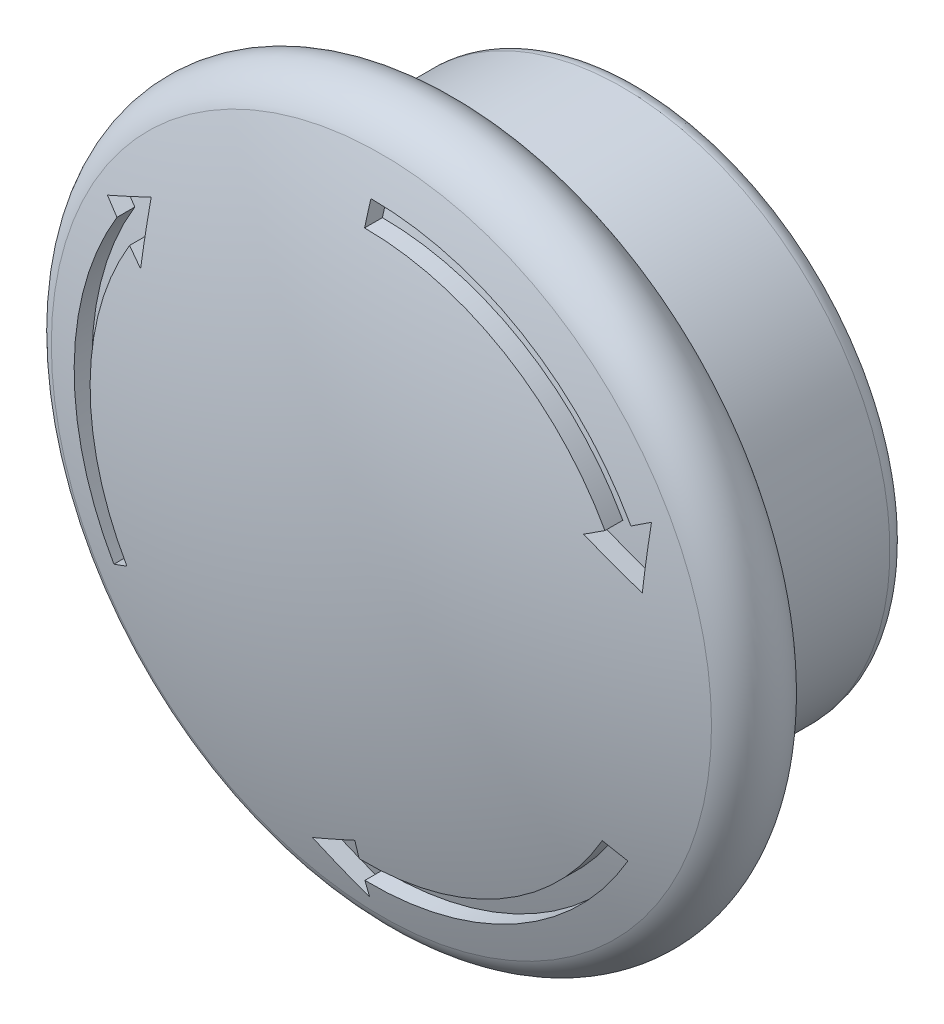
ISO-10303-21;
HEADER;
FILE_DESCRIPTION(('STEP AP214'),'2;1');
FILE_NAME('part.step','',(''),(''),'','','');
FILE_SCHEMA(('AUTOMOTIVE_DESIGN { 1 0 10303 214 1 1 1 1 }'));
ENDSEC;
DATA;
#1=APPLICATION_CONTEXT('core data for automotive mechanical design processes');
#2=APPLICATION_PROTOCOL_DEFINITION('international standard','automotive_design',2000,#1);
#3=PRODUCT_CONTEXT('',#1,'mechanical');
#4=PRODUCT('Part','Part','',(#3));
#5=PRODUCT_RELATED_PRODUCT_CATEGORY('part','',(#4));
#6=PRODUCT_DEFINITION_FORMATION('','',#4);
#7=PRODUCT_DEFINITION_CONTEXT('part definition',#1,'design');
#8=PRODUCT_DEFINITION('design','',#6,#7);
#9=PRODUCT_DEFINITION_SHAPE('','',#8);
#10=(LENGTH_UNIT() NAMED_UNIT(*) SI_UNIT(.MILLI.,.METRE.));
#11=(NAMED_UNIT(*) PLANE_ANGLE_UNIT() SI_UNIT($,.RADIAN.));
#12=(NAMED_UNIT(*) SI_UNIT($,.STERADIAN.) SOLID_ANGLE_UNIT());
#13=UNCERTAINTY_MEASURE_WITH_UNIT(LENGTH_MEASURE(1.E-05),#10,'distance_accuracy_value','');
#14=(GEOMETRIC_REPRESENTATION_CONTEXT(3) GLOBAL_UNCERTAINTY_ASSIGNED_CONTEXT((#13)) GLOBAL_UNIT_ASSIGNED_CONTEXT((#10,
#11,#12)) REPRESENTATION_CONTEXT('',''));
#15=CARTESIAN_POINT('',(0.,0.,0.));
#16=DIRECTION('',(0.,0.,1.));
#17=DIRECTION('',(1.,0.,0.));
#18=AXIS2_PLACEMENT_3D('',#15,#16,#17);
#19=CARTESIAN_POINT('',(0.,34.,32.4583333333333));
#20=DIRECTION('',(0.,0.,-1.));
#21=DIRECTION('',(1.,0.,0.));
#22=AXIS2_PLACEMENT_3D('',#19,#20,#21);
#23=SPHERICAL_SURFACE('',#22,58.5416666666667);
#24=CARTESIAN_POINT('',(0.,34.,88.));
#25=DIRECTION('',(0.,0.,-1.));
#26=DIRECTION('',(-1.,0.,0.));
#27=AXIS2_PLACEMENT_3D('',#24,#25,#26);
#28=CIRCLE('',#27,18.5);
#29=CARTESIAN_POINT('',(-18.5,34.,88.));
#30=VERTEX_POINT('',#29);
#31=EDGE_CURVE('E405',#30,#30,#28,.T.);
#32=ORIENTED_EDGE('',*,*,#31,.F.);
#33=EDGE_LOOP('',(#32));
#34=FACE_BOUND('',#33,.T.);
#35=CARTESIAN_POINT('',(15.1736395108025,33.568315174557,32.4583333333333));
#36=DIRECTION('',(-0.999595554031887,0.0284381497233161,0.));
#37=DIRECTION('',(-0.0284381497233161,-0.999595554031887,0.));
#38=AXIS2_PLACEMENT_3D('',#35,#36,#37);
#39=CIRCLE('',#38,56.5393760871024);
#40=CARTESIAN_POINT('',(15.4273371829423,42.4857400987002,88.2894735557238));
#41=VERTEX_POINT('',#40);
#42=CARTESIAN_POINT('',(15.334363418927,39.2177299765408,88.7145270237999));
#43=VERTEX_POINT('',#42);
#44=EDGE_CURVE('E431',#41,#43,#39,.F.);
#45=ORIENTED_EDGE('',*,*,#44,.T.);
#46=CARTESIAN_POINT('',(6.54714618894183,44.6299230435225,32.4583333333333));
#47=DIRECTION('',(0.524425937112959,0.851456068439937,0.));
#48=DIRECTION('',(-0.851456068439937,0.524425937112959,0.));
#49=AXIS2_PLACEMENT_3D('',#46,#47,#48);
#50=CIRCLE('',#49,57.1949853481975);
#51=CARTESIAN_POINT('',(12.55067051532,40.9322526791432,89.2170443697857));
#52=VERTEX_POINT('',#51);
#53=EDGE_CURVE('E434',#43,#52,#50,.F.);
#54=ORIENTED_EDGE('',*,*,#53,.T.);
#55=CARTESIAN_POINT('',(-0.0646001411496262,34.1196231591124,32.4583333333333));
#56=DIRECTION('',(0.475169616918934,-0.879894218163248,0.));
#57=DIRECTION('',(0.879894218163248,0.475169616918934,0.));
#58=AXIS2_PLACEMENT_3D('',#55,#56,#57);
#59=CIRCLE('',#58,58.5415088055704);
#60=CARTESIAN_POINT('',(13.4703718400252,41.4289193432932,88.9427291962034));
#61=VERTEX_POINT('',#60);
#62=EDGE_CURVE('E419',#52,#61,#59,.F.);
#63=ORIENTED_EDGE('',*,*,#62,.T.);
#64=CARTESIAN_POINT('',(0.,34.,88.9427291962034));
#65=DIRECTION('',(0.,0.,-1.));
#66=DIRECTION('',(-1.,0.,0.));
#67=AXIS2_PLACEMENT_3D('',#64,#65,#66);
#68=CIRCLE('',#67,15.3830998214826);
#69=CARTESIAN_POINT('',(0.,49.3830998214826,88.9427291962034));
#70=VERTEX_POINT('',#69);
#71=EDGE_CURVE('E417',#70,#61,#68,.T.);
#72=ORIENTED_EDGE('',*,*,#71,.F.);
#73=CARTESIAN_POINT('',(0.,34.,32.4583333333333));
#74=DIRECTION('',(1.,0.,0.));
#75=DIRECTION('',(0.,1.,0.));
#76=AXIS2_PLACEMENT_3D('',#73,#74,#75);
#77=CIRCLE('',#76,58.5416666666667);
#78=CARTESIAN_POINT('',(0.,50.6313864869628,88.5878596063421));
#79=VERTEX_POINT('',#78);
#80=EDGE_CURVE('E422',#70,#79,#77,.F.);
#81=ORIENTED_EDGE('',*,*,#80,.T.);
#82=CARTESIAN_POINT('',(0.,34.,88.5878596063421));
#83=DIRECTION('',(0.,0.,-1.));
#84=DIRECTION('',(-1.,0.,0.));
#85=AXIS2_PLACEMENT_3D('',#82,#83,#84);
#86=CIRCLE('',#85,16.6313864869628);
#87=CARTESIAN_POINT('',(14.5687717363032,42.0220886665644,88.5878596063421));
#88=VERTEX_POINT('',#87);
#89=EDGE_CURVE('E425',#79,#88,#86,.T.);
#90=ORIENTED_EDGE('',*,*,#89,.T.);
#91=CARTESIAN_POINT('',(-0.0646001411496861,34.1196231591125,32.4583333333333));
#92=DIRECTION('',(0.475169616918926,-0.879894218163252,0.));
#93=DIRECTION('',(0.879894218163253,0.475169616918926,0.));
#94=AXIS2_PLACEMENT_3D('',#91,#92,#93);
#95=CIRCLE('',#94,58.5415088055704);
#96=EDGE_CURVE('E428',#88,#41,#95,.F.);
#97=ORIENTED_EDGE('',*,*,#96,.T.);
#98=EDGE_LOOP('',(#45,#54,#63,#72,#81,#90,#97));
#99=FACE_BOUND('',#98,.T.);
#100=CARTESIAN_POINT('',(-7.21296973013926,47.3565996969438,32.4583333333333));
#101=DIRECTION('',(0.475169616918919,-0.879894218163256,0.));
#102=DIRECTION('',(0.879894218163256,0.475169616918919,0.));
#103=AXIS2_PLACEMENT_3D('',#100,#101,#102);
#104=CIRCLE('',#103,56.5393760871024);
#105=CARTESIAN_POINT('',(-15.0625350868577,43.1175958638263,88.2894735557238));
#106=VERTEX_POINT('',#105);
#107=CARTESIAN_POINT('',(-12.1858684192353,44.6710832833833,88.7145270237999));
#108=VERTEX_POINT('',#107);
#109=EDGE_CURVE('E451',#106,#108,#104,.F.);
#110=ORIENTED_EDGE('',*,*,#109,.T.);
#111=CARTESIAN_POINT('',(-12.479356490435,34.355033400153,32.4583333333333));
#112=DIRECTION('',(-0.999595554031886,0.0284381497233245,0.));
#113=DIRECTION('',(-0.0284381497233245,-0.999595554031886,0.));
#114=AXIS2_PLACEMENT_3D('',#111,#112,#113);
#115=CIRCLE('',#114,57.1949853481975);
#116=CARTESIAN_POINT('',(-12.2788421832507,41.403073161224,89.2170443697857));
#117=VERTEX_POINT('',#116);
#118=EDGE_CURVE('E454',#108,#117,#115,.F.);
#119=ORIENTED_EDGE('',*,*,#118,.T.);
#120=CARTESIAN_POINT('',(-0.071296624097556,33.8842430571201,32.4583333333333));
#121=DIRECTION('',(0.524425937112967,0.851456068439932,0.));
#122=DIRECTION('',(-0.851456068439932,0.524425937112967,0.));
#123=AXIS2_PLACEMENT_3D('',#120,#121,#122);
#124=CIRCLE('',#123,58.5415088055704);
#125=CARTESIAN_POINT('',(-13.16881879397,41.9512245402379,88.9427291962034));
#126=VERTEX_POINT('',#125);
#127=EDGE_CURVE('E439',#117,#126,#124,.F.);
#128=ORIENTED_EDGE('',*,*,#127,.T.);
#129=CARTESIAN_POINT('',(0.,34.,88.9427291962034));
#130=DIRECTION('',(0.,0.,-1.));
#131=DIRECTION('',(-1.,0.,0.));
#132=AXIS2_PLACEMENT_3D('',#129,#130,#131);
#133=CIRCLE('',#132,15.3830998214826);
#134=CARTESIAN_POINT('',(-13.3221552343559,26.3084500892588,88.9427291962034));
#135=VERTEX_POINT('',#134);
#136=EDGE_CURVE('E437',#135,#126,#133,.T.);
#137=ORIENTED_EDGE('',*,*,#136,.F.);
#138=CARTESIAN_POINT('',(0.,34.,32.4583333333333));
#139=DIRECTION('',(-0.499999999999989,0.866025403784445,0.));
#140=DIRECTION('',(-0.866025403784445,-0.499999999999989,0.));
#141=AXIS2_PLACEMENT_3D('',#138,#139,#140);
#142=CIRCLE('',#141,58.5416666666667);
#143=CARTESIAN_POINT('',(-14.4032031978671,25.6843067565187,88.5878596063421));
#144=VERTEX_POINT('',#143);
#145=EDGE_CURVE('E442',#135,#144,#142,.F.);
#146=ORIENTED_EDGE('',*,*,#145,.T.);
#147=CARTESIAN_POINT('',(0.,34.,88.5878596063421));
#148=DIRECTION('',(0.,0.,-1.));
#149=DIRECTION('',(-1.,0.,0.));
#150=AXIS2_PLACEMENT_3D('',#147,#148,#149);
#151=CIRCLE('',#150,16.6313864869628);
#152=CARTESIAN_POINT('',(-14.2317184448076,42.6058820922932,88.5878596063421));
#153=VERTEX_POINT('',#152);
#154=EDGE_CURVE('E445',#144,#153,#151,.T.);
#155=ORIENTED_EDGE('',*,*,#154,.T.);
#156=CARTESIAN_POINT('',(-0.0712966240975966,33.88424305712,32.4583333333333));
#157=DIRECTION('',(0.524425937112971,0.85145606843993,0.));
#158=DIRECTION('',(-0.85145606843993,0.524425937112971,0.));
#159=AXIS2_PLACEMENT_3D('',#156,#157,#158);
#160=CIRCLE('',#159,58.5415088055704);
#161=EDGE_CURVE('E448',#153,#106,#160,.F.);
#162=ORIENTED_EDGE('',*,*,#161,.T.);
#163=EDGE_LOOP('',(#110,#119,#128,#137,#146,#155,#162));
#164=FACE_BOUND('',#163,.T.);
#165=CARTESIAN_POINT('',(-7.96066978066316,21.0750851284993,32.4583333333333));
#166=DIRECTION('',(0.524425937112964,0.851456068439934,0.));
#167=DIRECTION('',(-0.851456068439934,0.524425937112964,0.));
#168=AXIS2_PLACEMENT_3D('',#165,#166,#167);
#169=CIRCLE('',#168,56.5393760871024);
#170=CARTESIAN_POINT('',(-0.364802096084629,16.3966640374736,88.2894735557238));
#171=VERTEX_POINT('',#170);
#172=CARTESIAN_POINT('',(-3.14849499969166,18.111186740076,88.7145270237999));
#173=VERTEX_POINT('',#172);
#174=EDGE_CURVE('E65',#171,#173,#169,.F.);
#175=ORIENTED_EDGE('',*,*,#174,.T.);
#176=CARTESIAN_POINT('',(5.93221030149311,23.0150435563246,32.4583333333333));
#177=DIRECTION('',(0.475169616918922,-0.879894218163255,0.));
#178=DIRECTION('',(0.879894218163255,0.475169616918922,0.));
#179=AXIS2_PLACEMENT_3D('',#176,#177,#178);
#180=CIRCLE('',#179,57.1949853481975);
#181=CARTESIAN_POINT('',(-0.271828332069332,19.664674159633,89.2170443697857));
#182=VERTEX_POINT('',#181);
#183=EDGE_CURVE('E12',#173,#182,#180,.F.);
#184=ORIENTED_EDGE('',*,*,#183,.T.);
#185=CARTESIAN_POINT('',(0.135896765247218,33.9961337837674,32.4583333333333));
#186=DIRECTION('',(-0.999595554031887,0.0284381497233193,0.));
#187=DIRECTION('',(-0.0284381497233193,-0.999595554031887,0.));
#188=AXIS2_PLACEMENT_3D('',#185,#186,#187);
#189=CIRCLE('',#188,58.5415088055704);
#190=CARTESIAN_POINT('',(-0.301553046055177,18.6198561164691,88.9427291962034));
#191=VERTEX_POINT('',#190);
#192=EDGE_CURVE('E459',#182,#191,#189,.F.);
#193=ORIENTED_EDGE('',*,*,#192,.T.);
#194=CARTESIAN_POINT('',(0.,34.,88.9427291962034));
#195=DIRECTION('',(0.,0.,-1.));
#196=DIRECTION('',(-1.,0.,0.));
#197=AXIS2_PLACEMENT_3D('',#194,#195,#196);
#198=CIRCLE('',#197,15.3830998214826);
#199=CARTESIAN_POINT('',(13.3221552343558,26.3084500892586,88.9427291962034));
#200=VERTEX_POINT('',#199);
#201=EDGE_CURVE('E457',#200,#191,#198,.T.);
#202=ORIENTED_EDGE('',*,*,#201,.F.);
#203=CARTESIAN_POINT('',(0.,34.0000000000001,32.4583333333333));
#204=DIRECTION('',(-0.500000000000008,-0.866025403784434,0.));
#205=DIRECTION('',(0.866025403784434,-0.500000000000008,0.));
#206=AXIS2_PLACEMENT_3D('',#203,#204,#205);
#207=CIRCLE('',#206,58.5416666666667);
#208=CARTESIAN_POINT('',(14.4032031978669,25.6843067565185,88.5878596063421));
#209=VERTEX_POINT('',#208);
#210=EDGE_CURVE('E462',#200,#209,#207,.F.);
#211=ORIENTED_EDGE('',*,*,#210,.T.);
#212=CARTESIAN_POINT('',(0.,34.,88.5878596063421));
#213=DIRECTION('',(0.,0.,-1.));
#214=DIRECTION('',(-1.,0.,0.));
#215=AXIS2_PLACEMENT_3D('',#212,#213,#214);
#216=CIRCLE('',#215,16.6313864869628);
#217=CARTESIAN_POINT('',(-0.337053291495628,17.3720292411425,88.5878596063421));
#218=VERTEX_POINT('',#217);
#219=EDGE_CURVE('E465',#209,#218,#216,.T.);
#220=ORIENTED_EDGE('',*,*,#219,.T.);
#221=CARTESIAN_POINT('',(0.135896765247465,33.9961337837674,32.4583333333333));
#222=DIRECTION('',(-0.999595554031886,0.0284381497233339,0.));
#223=DIRECTION('',(-0.0284381497233339,-0.999595554031886,0.));
#224=AXIS2_PLACEMENT_3D('',#221,#222,#223);
#225=CIRCLE('',#224,58.5415088055704);
#226=EDGE_CURVE('E468',#218,#171,#225,.F.);
#227=ORIENTED_EDGE('',*,*,#226,.T.);
#228=EDGE_LOOP('',(#175,#184,#193,#202,#211,#220,#227));
#229=FACE_BOUND('',#228,.T.);
#230=ADVANCED_FACE('F57',(#34,#99,#164,#229),#23,.T.);
#231=CARTESIAN_POINT('',(0.,34.,85.75));
#232=DIRECTION('',(0.,0.,-1.));
#233=DIRECTION('',(-1.,0.,0.));
#234=AXIS2_PLACEMENT_3D('',#231,#232,#233);
#235=TOROIDAL_SURFACE('',#234,17.5625,2.4375);
#236=ORIENTED_EDGE('',*,*,#31,.T.);
#237=EDGE_LOOP('',(#236));
#238=FACE_BOUND('',#237,.T.);
#239=CARTESIAN_POINT('',(0.,34.,83.5));
#240=DIRECTION('',(0.,0.,-1.));
#241=DIRECTION('',(-1.,0.,0.));
#242=AXIS2_PLACEMENT_3D('',#239,#240,#241);
#243=CIRCLE('',#242,18.5);
#244=CARTESIAN_POINT('',(-18.5,34.,83.5));
#245=VERTEX_POINT('',#244);
#246=EDGE_CURVE('E406',#245,#245,#243,.T.);
#247=ORIENTED_EDGE('',*,*,#246,.F.);
#248=EDGE_LOOP('',(#247));
#249=FACE_BOUND('',#248,.T.);
#250=ADVANCED_FACE('F486',(#238,#249),#235,.T.);
#251=CARTESIAN_POINT('',(0.,34.,83.5));
#252=DIRECTION('',(0.,0.,-1.));
#253=DIRECTION('',(-1.,0.,0.));
#254=AXIS2_PLACEMENT_3D('',#251,#252,#253);
#255=PLANE('',#254);
#256=CARTESIAN_POINT('',(0.,34.,83.5));
#257=DIRECTION('',(0.,0.,-1.));
#258=DIRECTION('',(-1.,0.,0.));
#259=AXIS2_PLACEMENT_3D('',#256,#257,#258);
#260=CIRCLE('',#259,15.);
#261=CARTESIAN_POINT('',(-15.,34.,83.5));
#262=VERTEX_POINT('',#261);
#263=EDGE_CURVE('E396',#262,#262,#260,.T.);
#264=ORIENTED_EDGE('',*,*,#263,.F.);
#265=EDGE_LOOP('',(#264));
#266=FACE_BOUND('',#265,.T.);
#267=ORIENTED_EDGE('',*,*,#246,.T.);
#268=EDGE_LOOP('',(#267));
#269=FACE_BOUND('',#268,.T.);
#270=ADVANCED_FACE('F492',(#266,#269),#255,.T.);
#271=CARTESIAN_POINT('',(0.,34.,73.5));
#272=DIRECTION('',(0.,0.,1.));
#273=DIRECTION('',(1.,0.,0.));
#274=AXIS2_PLACEMENT_3D('',#271,#272,#273);
#275=CYLINDRICAL_SURFACE('',#274,15.);
#276=CARTESIAN_POINT('',(0.,34.,74.5));
#277=DIRECTION('',(0.,0.,-1.));
#278=DIRECTION('',(-1.,0.,0.));
#279=AXIS2_PLACEMENT_3D('',#276,#277,#278);
#280=CIRCLE('',#279,15.);
#281=CARTESIAN_POINT('',(-15.,34.,74.5));
#282=VERTEX_POINT('',#281);
#283=EDGE_CURVE('E414',#282,#282,#280,.F.);
#284=ORIENTED_EDGE('',*,*,#283,.T.);
#285=EDGE_LOOP('',(#284));
#286=FACE_BOUND('',#285,.T.);
#287=ORIENTED_EDGE('',*,*,#263,.T.);
#288=EDGE_LOOP('',(#287));
#289=FACE_BOUND('',#288,.T.);
#290=ADVANCED_FACE('F499',(#286,#289),#275,.T.);
#291=CARTESIAN_POINT('',(0.,34.,73.5));
#292=DIRECTION('',(0.,0.,-1.));
#293=DIRECTION('',(-1.,0.,0.));
#294=AXIS2_PLACEMENT_3D('',#291,#292,#293);
#295=PLANE('',#294);
#296=CARTESIAN_POINT('',(0.,34.,73.5));
#297=DIRECTION('',(0.,0.,-1.));
#298=DIRECTION('',(-1.,0.,0.));
#299=AXIS2_PLACEMENT_3D('',#296,#297,#298);
#300=CIRCLE('',#299,14.);
#301=CARTESIAN_POINT('',(-14.,34.,73.5));
#302=VERTEX_POINT('',#301);
#303=EDGE_CURVE('E404',#302,#302,#300,.T.);
#304=ORIENTED_EDGE('',*,*,#303,.T.);
#305=EDGE_LOOP('',(#304));
#306=FACE_BOUND('',#305,.T.);
#307=ADVANCED_FACE('F502',(#306),#295,.T.);
#308=CARTESIAN_POINT('',(0.,34.,74.5));
#309=DIRECTION('',(0.,0.,-1.));
#310=DIRECTION('',(-1.,0.,0.));
#311=AXIS2_PLACEMENT_3D('',#308,#309,#310);
#312=TOROIDAL_SURFACE('',#311,14.,1.);
#313=ORIENTED_EDGE('',*,*,#283,.F.);
#314=EDGE_LOOP('',(#313));
#315=FACE_BOUND('',#314,.T.);
#316=ORIENTED_EDGE('',*,*,#303,.F.);
#317=EDGE_LOOP('',(#316));
#318=FACE_BOUND('',#317,.T.);
#319=ADVANCED_FACE('F59',(#315,#318),#312,.T.);
#320=CARTESIAN_POINT('',(15.4273371829423,42.4857400987002,88.2894735557238));
#321=DIRECTION('',(0.475169616918926,-0.879894218163252,0.));
#322=DIRECTION('',(0.879894218163253,0.475169616918926,0.));
#323=AXIS2_PLACEMENT_3D('',#320,#321,#322);
#324=PLANE('',#323);
#325=DIRECTION('',(0.,0.,1.));
#326=VECTOR('',#325,1.);
#327=CARTESIAN_POINT('',(14.5687717363032,42.0220886665644,88.5878596063421));
#328=LINE('',#327,#326);
#329=CARTESIAN_POINT('',(14.5687717363032,42.0220886665644,87.5878596063421));
#330=VERTEX_POINT('',#329);
#331=EDGE_CURVE('E813',#330,#88,#328,.T.);
#332=ORIENTED_EDGE('',*,*,#331,.F.);
#333=CARTESIAN_POINT('',(-0.0646001411496877,34.1196231591125,31.4583333333333));
#334=DIRECTION('',(-0.475169616918926,0.879894218163252,0.));
#335=DIRECTION('',(-0.879894218163252,-0.475169616918926,0.));
#336=AXIS2_PLACEMENT_3D('',#333,#334,#335);
#337=CIRCLE('',#336,58.5415088055704);
#338=CARTESIAN_POINT('',(15.4273371829423,42.4857400987002,87.2894735557238));
#339=VERTEX_POINT('',#338);
#340=EDGE_CURVE('E210',#330,#339,#337,.T.);
#341=ORIENTED_EDGE('',*,*,#340,.T.);
#342=DIRECTION('',(0.,0.,1.));
#343=VECTOR('',#342,1.);
#344=CARTESIAN_POINT('',(15.4273371829423,42.4857400987002,88.2894735557238));
#345=LINE('',#344,#343);
#346=EDGE_CURVE('E807',#339,#41,#345,.T.);
#347=ORIENTED_EDGE('',*,*,#346,.T.);
#348=ORIENTED_EDGE('',*,*,#96,.F.);
#349=EDGE_LOOP('',(#332,#341,#347,#348));
#350=FACE_BOUND('',#349,.T.);
#351=ADVANCED_FACE('F363',(#350),#324,.T.);
#352=CARTESIAN_POINT('',(0.,34.,88.5878596063421));
#353=DIRECTION('',(0.,0.,1.));
#354=DIRECTION('',(1.,0.,0.));
#355=AXIS2_PLACEMENT_3D('',#352,#353,#354);
#356=CYLINDRICAL_SURFACE('',#355,16.6313864869628);
#357=DIRECTION('',(0.,0.,1.));
#358=VECTOR('',#357,1.);
#359=CARTESIAN_POINT('',(0.,50.6313864869628,88.5878596063421));
#360=LINE('',#359,#358);
#361=CARTESIAN_POINT('',(0.,50.6313864869628,87.5878596063421));
#362=VERTEX_POINT('',#361);
#363=EDGE_CURVE('E812',#362,#79,#360,.T.);
#364=ORIENTED_EDGE('',*,*,#363,.F.);
#365=CARTESIAN_POINT('',(0.,34.,87.5878596063421));
#366=DIRECTION('',(0.,0.,-1.));
#367=DIRECTION('',(-1.,0.,0.));
#368=AXIS2_PLACEMENT_3D('',#365,#366,#367);
#369=CIRCLE('',#368,16.6313864869628);
#370=EDGE_CURVE('E819',#362,#330,#369,.T.);
#371=ORIENTED_EDGE('',*,*,#370,.T.);
#372=ORIENTED_EDGE('',*,*,#331,.T.);
#373=ORIENTED_EDGE('',*,*,#89,.F.);
#374=EDGE_LOOP('',(#364,#371,#372,#373));
#375=FACE_BOUND('',#374,.T.);
#376=ADVANCED_FACE('F366',(#375),#356,.F.);
#377=CARTESIAN_POINT('',(0.,50.6313864869628,88.5878596063421));
#378=DIRECTION('',(1.,0.,0.));
#379=DIRECTION('',(0.,1.,0.));
#380=AXIS2_PLACEMENT_3D('',#377,#378,#379);
#381=PLANE('',#380);
#382=DIRECTION('',(0.,0.,1.));
#383=VECTOR('',#382,1.);
#384=CARTESIAN_POINT('',(0.,49.3830998214826,88.9427291962034));
#385=LINE('',#384,#383);
#386=CARTESIAN_POINT('',(0.,49.3830998214826,87.9427291962034));
#387=VERTEX_POINT('',#386);
#388=EDGE_CURVE('E858',#387,#70,#385,.T.);
#389=ORIENTED_EDGE('',*,*,#388,.F.);
#390=CARTESIAN_POINT('',(0.,34.,31.4583333333333));
#391=DIRECTION('',(-1.,0.,0.));
#392=DIRECTION('',(0.,-1.,0.));
#393=AXIS2_PLACEMENT_3D('',#390,#391,#392);
#394=CIRCLE('',#393,58.5416666666667);
#395=EDGE_CURVE('E835',#387,#362,#394,.T.);
#396=ORIENTED_EDGE('',*,*,#395,.T.);
#397=ORIENTED_EDGE('',*,*,#363,.T.);
#398=ORIENTED_EDGE('',*,*,#80,.F.);
#399=EDGE_LOOP('',(#389,#396,#397,#398));
#400=FACE_BOUND('',#399,.T.);
#401=ADVANCED_FACE('F370',(#400),#381,.T.);
#402=CARTESIAN_POINT('',(13.4703718400252,41.4289193432932,88.9427291962034));
#403=DIRECTION('',(0.475169616918934,-0.879894218163248,0.));
#404=DIRECTION('',(0.879894218163248,0.475169616918934,0.));
#405=AXIS2_PLACEMENT_3D('',#402,#403,#404);
#406=PLANE('',#405);
#407=DIRECTION('',(0.,0.,1.));
#408=VECTOR('',#407,1.);
#409=CARTESIAN_POINT('',(12.55067051532,40.9322526791432,89.2170443697857));
#410=LINE('',#409,#408);
#411=CARTESIAN_POINT('',(12.55067051532,40.9322526791432,88.2170443697857));
#412=VERTEX_POINT('',#411);
#413=EDGE_CURVE('E848',#412,#52,#410,.T.);
#414=ORIENTED_EDGE('',*,*,#413,.F.);
#415=CARTESIAN_POINT('',(-0.0646001411496715,34.1196231591125,31.4583333333333));
#416=DIRECTION('',(-0.475169616918928,0.879894218163251,0.));
#417=DIRECTION('',(-0.879894218163251,-0.475169616918928,0.));
#418=AXIS2_PLACEMENT_3D('',#415,#416,#417);
#419=CIRCLE('',#418,58.5415088055704);
#420=CARTESIAN_POINT('',(13.4703718400252,41.4289193432932,87.9427291962034));
#421=VERTEX_POINT('',#420);
#422=EDGE_CURVE('E824',#412,#421,#419,.T.);
#423=ORIENTED_EDGE('',*,*,#422,.T.);
#424=DIRECTION('',(0.,0.,1.));
#425=VECTOR('',#424,1.);
#426=CARTESIAN_POINT('',(13.4703718400252,41.4289193432932,88.9427291962034));
#427=LINE('',#426,#425);
#428=EDGE_CURVE('E853',#421,#61,#427,.T.);
#429=ORIENTED_EDGE('',*,*,#428,.T.);
#430=ORIENTED_EDGE('',*,*,#62,.F.);
#431=EDGE_LOOP('',(#414,#423,#429,#430));
#432=FACE_BOUND('',#431,.T.);
#433=ADVANCED_FACE('F374',(#432),#406,.T.);
#434=CARTESIAN_POINT('',(12.55067051532,40.9322526791432,89.2170443697857));
#435=DIRECTION('',(0.524425937112959,0.851456068439937,0.));
#436=DIRECTION('',(-0.851456068439937,0.524425937112959,0.));
#437=AXIS2_PLACEMENT_3D('',#434,#435,#436);
#438=PLANE('',#437);
#439=DIRECTION('',(0.,0.,1.));
#440=VECTOR('',#439,1.);
#441=CARTESIAN_POINT('',(15.334363418927,39.2177299765408,88.7145270237999));
#442=LINE('',#441,#440);
#443=CARTESIAN_POINT('',(15.334363418927,39.2177299765408,87.7145270237999));
#444=VERTEX_POINT('',#443);
#445=EDGE_CURVE('E409',#444,#43,#442,.T.);
#446=ORIENTED_EDGE('',*,*,#445,.F.);
#447=CARTESIAN_POINT('',(15.334363418927,39.2177299765408,87.7145270237999));
#448=CARTESIAN_POINT('',(13.9487057701552,40.0711795412451,88.013073858939));
#449=CARTESIAN_POINT('',(12.55067051532,40.9322526791432,88.2170443697857));
#450=B_SPLINE_CURVE_WITH_KNOTS('',2,(#447,#448,#449),.UNSPECIFIED.,.F.,.F.,(3,3),(0.,1.),.UNSPECIFIED.);
#451=EDGE_CURVE('E822',#444,#412,#450,.T.);
#452=ORIENTED_EDGE('',*,*,#451,.T.);
#453=ORIENTED_EDGE('',*,*,#413,.T.);
#454=ORIENTED_EDGE('',*,*,#53,.F.);
#455=EDGE_LOOP('',(#446,#452,#453,#454));
#456=FACE_BOUND('',#455,.T.);
#457=ADVANCED_FACE('F382',(#456),#438,.T.);
#458=CARTESIAN_POINT('',(15.334363418927,39.2177299765408,88.7145270237999));
#459=DIRECTION('',(-0.999595554031887,0.0284381497233161,0.));
#460=DIRECTION('',(-0.0284381497233161,-0.999595554031887,0.));
#461=AXIS2_PLACEMENT_3D('',#458,#459,#460);
#462=PLANE('',#461);
#463=ORIENTED_EDGE('',*,*,#346,.F.);
#464=CARTESIAN_POINT('',(15.1736395108025,33.568315174557,31.4583333333333));
#465=DIRECTION('',(0.999595554031887,-0.028438149723316,0.));
#466=DIRECTION('',(0.028438149723316,0.999595554031887,0.));
#467=AXIS2_PLACEMENT_3D('',#464,#465,#466);
#468=CIRCLE('',#467,56.5393760871024);
#469=EDGE_CURVE('E811',#339,#444,#468,.T.);
#470=ORIENTED_EDGE('',*,*,#469,.T.);
#471=ORIENTED_EDGE('',*,*,#445,.T.);
#472=ORIENTED_EDGE('',*,*,#44,.F.);
#473=EDGE_LOOP('',(#463,#470,#471,#472));
#474=FACE_BOUND('',#473,.T.);
#475=ADVANCED_FACE('F378',(#474),#462,.T.);
#476=CARTESIAN_POINT('',(0.,34.,88.9427291962034));
#477=DIRECTION('',(0.,0.,1.));
#478=DIRECTION('',(1.,0.,0.));
#479=AXIS2_PLACEMENT_3D('',#476,#477,#478);
#480=CYLINDRICAL_SURFACE('',#479,15.3830998214826);
#481=ORIENTED_EDGE('',*,*,#71,.T.);
#482=ORIENTED_EDGE('',*,*,#428,.F.);
#483=CARTESIAN_POINT('',(0.,34.,87.9427291962034));
#484=DIRECTION('',(0.,0.,-1.));
#485=DIRECTION('',(-1.,0.,0.));
#486=AXIS2_PLACEMENT_3D('',#483,#484,#485);
#487=CIRCLE('',#486,15.3830998214826);
#488=EDGE_CURVE('E830',#387,#421,#487,.T.);
#489=ORIENTED_EDGE('',*,*,#488,.F.);
#490=ORIENTED_EDGE('',*,*,#388,.T.);
#491=EDGE_LOOP('',(#481,#482,#489,#490));
#492=FACE_BOUND('',#491,.T.);
#493=ADVANCED_FACE('F361',(#492),#480,.T.);
#494=CARTESIAN_POINT('',(0.,34.,31.4583333333333));
#495=DIRECTION('',(0.,0.,-1.));
#496=DIRECTION('',(1.,0.,0.));
#497=AXIS2_PLACEMENT_3D('',#494,#495,#496);
#498=SPHERICAL_SURFACE('',#497,58.5416666666667);
#499=ORIENTED_EDGE('',*,*,#469,.F.);
#500=ORIENTED_EDGE('',*,*,#340,.F.);
#501=ORIENTED_EDGE('',*,*,#370,.F.);
#502=ORIENTED_EDGE('',*,*,#395,.F.);
#503=ORIENTED_EDGE('',*,*,#488,.T.);
#504=ORIENTED_EDGE('',*,*,#422,.F.);
#505=ORIENTED_EDGE('',*,*,#451,.F.);
#506=EDGE_LOOP('',(#499,#500,#501,#502,#503,#504,#505));
#507=FACE_BOUND('',#506,.T.);
#508=ADVANCED_FACE('F314',(#507),#498,.T.);
#509=CARTESIAN_POINT('',(-15.0625350868577,43.1175958638263,88.2894735557238));
#510=DIRECTION('',(0.524425937112971,0.85145606843993,0.));
#511=DIRECTION('',(-0.85145606843993,0.524425937112971,0.));
#512=AXIS2_PLACEMENT_3D('',#509,#510,#511);
#513=PLANE('',#512);
#514=DIRECTION('',(0.,0.,1.));
#515=VECTOR('',#514,1.);
#516=CARTESIAN_POINT('',(-14.2317184448076,42.6058820922932,88.5878596063421));
#517=LINE('',#516,#515);
#518=CARTESIAN_POINT('',(-14.2317184448076,42.6058820922932,87.5878596063421));
#519=VERTEX_POINT('',#518);
#520=EDGE_CURVE('E744',#519,#153,#517,.T.);
#521=ORIENTED_EDGE('',*,*,#520,.F.);
#522=CARTESIAN_POINT('',(-0.0712966240975734,33.88424305712,31.4583333333333));
#523=DIRECTION('',(-0.524425937112968,-0.851456068439931,0.));
#524=DIRECTION('',(0.851456068439931,-0.524425937112968,0.));
#525=AXIS2_PLACEMENT_3D('',#522,#523,#524);
#526=CIRCLE('',#525,58.5415088055704);
#527=CARTESIAN_POINT('',(-15.0625350868577,43.1175958638263,87.2894735557238));
#528=VERTEX_POINT('',#527);
#529=EDGE_CURVE('E747',#519,#528,#526,.T.);
#530=ORIENTED_EDGE('',*,*,#529,.T.);
#531=DIRECTION('',(0.,0.,1.));
#532=VECTOR('',#531,1.);
#533=CARTESIAN_POINT('',(-15.0625350868577,43.1175958638263,88.2894735557238));
#534=LINE('',#533,#532);
#535=EDGE_CURVE('E737',#528,#106,#534,.T.);
#536=ORIENTED_EDGE('',*,*,#535,.T.);
#537=ORIENTED_EDGE('',*,*,#161,.F.);
#538=EDGE_LOOP('',(#521,#530,#536,#537));
#539=FACE_BOUND('',#538,.T.);
#540=ADVANCED_FACE('F310',(#539),#513,.T.);
#541=CARTESIAN_POINT('',(0.,34.,88.5878596063421));
#542=DIRECTION('',(0.,0.,1.));
#543=DIRECTION('',(1.,0.,0.));
#544=AXIS2_PLACEMENT_3D('',#541,#542,#543);
#545=CYLINDRICAL_SURFACE('',#544,16.6313864869628);
#546=DIRECTION('',(0.,0.,1.));
#547=VECTOR('',#546,1.);
#548=CARTESIAN_POINT('',(-14.4032031978671,25.6843067565187,88.5878596063421));
#549=LINE('',#548,#547);
#550=CARTESIAN_POINT('',(-14.4032031978671,25.6843067565187,87.5878596063421));
#551=VERTEX_POINT('',#550);
#552=EDGE_CURVE('E743',#551,#144,#549,.T.);
#553=ORIENTED_EDGE('',*,*,#552,.F.);
#554=CARTESIAN_POINT('',(0.,34.,87.5878596063421));
#555=DIRECTION('',(0.,0.,-1.));
#556=DIRECTION('',(-1.,0.,0.));
#557=AXIS2_PLACEMENT_3D('',#554,#555,#556);
#558=CIRCLE('',#557,16.6313864869628);
#559=EDGE_CURVE('E751',#551,#519,#558,.T.);
#560=ORIENTED_EDGE('',*,*,#559,.T.);
#561=ORIENTED_EDGE('',*,*,#520,.T.);
#562=ORIENTED_EDGE('',*,*,#154,.F.);
#563=EDGE_LOOP('',(#553,#560,#561,#562));
#564=FACE_BOUND('',#563,.T.);
#565=ADVANCED_FACE('F313',(#564),#545,.F.);
#566=CARTESIAN_POINT('',(-14.4032031978671,25.6843067565187,88.5878596063421));
#567=DIRECTION('',(-0.499999999999989,0.866025403784445,0.));
#568=DIRECTION('',(-0.866025403784445,-0.499999999999989,0.));
#569=AXIS2_PLACEMENT_3D('',#566,#567,#568);
#570=PLANE('',#569);
#571=DIRECTION('',(0.,0.,1.));
#572=VECTOR('',#571,1.);
#573=CARTESIAN_POINT('',(-13.3221552343559,26.3084500892588,88.9427291962034));
#574=LINE('',#573,#572);
#575=CARTESIAN_POINT('',(-13.3221552343559,26.3084500892588,87.9427291962034));
#576=VERTEX_POINT('',#575);
#577=EDGE_CURVE('E80',#576,#135,#574,.T.);
#578=ORIENTED_EDGE('',*,*,#577,.F.);
#579=CARTESIAN_POINT('',(0.,34.,31.4583333333333));
#580=DIRECTION('',(0.49999999999999,-0.866025403784444,0.));
#581=DIRECTION('',(0.866025403784445,0.49999999999999,0.));
#582=AXIS2_PLACEMENT_3D('',#579,#580,#581);
#583=CIRCLE('',#582,58.5416666666667);
#584=EDGE_CURVE('E768',#576,#551,#583,.T.);
#585=ORIENTED_EDGE('',*,*,#584,.T.);
#586=ORIENTED_EDGE('',*,*,#552,.T.);
#587=ORIENTED_EDGE('',*,*,#145,.F.);
#588=EDGE_LOOP('',(#578,#585,#586,#587));
#589=FACE_BOUND('',#588,.T.);
#590=ADVANCED_FACE('F318',(#589),#570,.T.);
#591=CARTESIAN_POINT('',(-13.16881879397,41.9512245402379,88.9427291962034));
#592=DIRECTION('',(0.524425937112967,0.851456068439932,0.));
#593=DIRECTION('',(-0.851456068439932,0.524425937112967,0.));
#594=AXIS2_PLACEMENT_3D('',#591,#592,#593);
#595=PLANE('',#594);
#596=DIRECTION('',(0.,0.,1.));
#597=VECTOR('',#596,1.);
#598=CARTESIAN_POINT('',(-12.2788421832507,41.403073161224,89.2170443697857));
#599=LINE('',#598,#597);
#600=CARTESIAN_POINT('',(-12.2788421832507,41.403073161224,88.2170443697857));
#601=VERTEX_POINT('',#600);
#602=EDGE_CURVE('E781',#601,#117,#599,.T.);
#603=ORIENTED_EDGE('',*,*,#602,.F.);
#604=CARTESIAN_POINT('',(-0.0712966240975555,33.8842430571201,31.4583333333333));
#605=DIRECTION('',(-0.524425937112967,-0.851456068439932,0.));
#606=DIRECTION('',(0.851456068439932,-0.524425937112967,0.));
#607=AXIS2_PLACEMENT_3D('',#604,#605,#606);
#608=CIRCLE('',#607,58.5415088055704);
#609=CARTESIAN_POINT('',(-13.16881879397,41.9512245402379,87.9427291962034));
#610=VERTEX_POINT('',#609);
#611=EDGE_CURVE('E757',#601,#610,#608,.T.);
#612=ORIENTED_EDGE('',*,*,#611,.T.);
#613=DIRECTION('',(0.,0.,1.));
#614=VECTOR('',#613,1.);
#615=CARTESIAN_POINT('',(-13.16881879397,41.9512245402379,88.9427291962034));
#616=LINE('',#615,#614);
#617=EDGE_CURVE('E786',#610,#126,#616,.T.);
#618=ORIENTED_EDGE('',*,*,#617,.T.);
#619=ORIENTED_EDGE('',*,*,#127,.F.);
#620=EDGE_LOOP('',(#603,#612,#618,#619));
#621=FACE_BOUND('',#620,.T.);
#622=ADVANCED_FACE('F322',(#621),#595,.T.);
#623=CARTESIAN_POINT('',(-12.2788421832507,41.403073161224,89.2170443697857));
#624=DIRECTION('',(-0.999595554031886,0.0284381497233245,0.));
#625=DIRECTION('',(-0.0284381497233245,-0.999595554031886,0.));
#626=AXIS2_PLACEMENT_3D('',#623,#624,#625);
#627=PLANE('',#626);
#628=DIRECTION('',(0.,0.,1.));
#629=VECTOR('',#628,1.);
#630=CARTESIAN_POINT('',(-12.1858684192353,44.6710832833833,88.7145270237999));
#631=LINE('',#630,#629);
#632=CARTESIAN_POINT('',(-12.1858684192353,44.6710832833833,87.7145270237999));
#633=VERTEX_POINT('',#632);
#634=EDGE_CURVE('E254',#633,#108,#631,.T.);
#635=ORIENTED_EDGE('',*,*,#634,.F.);
#636=CARTESIAN_POINT('',(-12.1858684192353,44.6710832833833,87.7145270237999));
#637=CARTESIAN_POINT('',(-12.2321485987322,43.0443437762464,88.013073858939));
#638=CARTESIAN_POINT('',(-12.2788421832507,41.403073161224,88.2170443697857));
#639=B_SPLINE_CURVE_WITH_KNOTS('',2,(#636,#637,#638),.UNSPECIFIED.,.F.,.F.,(3,3),(0.,1.),.UNSPECIFIED.);
#640=EDGE_CURVE('E754',#633,#601,#639,.T.);
#641=ORIENTED_EDGE('',*,*,#640,.T.);
#642=ORIENTED_EDGE('',*,*,#602,.T.);
#643=ORIENTED_EDGE('',*,*,#118,.F.);
#644=EDGE_LOOP('',(#635,#641,#642,#643));
#645=FACE_BOUND('',#644,.T.);
#646=ADVANCED_FACE('F329',(#645),#627,.T.);
#647=CARTESIAN_POINT('',(-12.1858684192353,44.6710832833833,88.7145270237999));
#648=DIRECTION('',(0.475169616918919,-0.879894218163256,0.));
#649=DIRECTION('',(0.879894218163256,0.475169616918919,0.));
#650=AXIS2_PLACEMENT_3D('',#647,#648,#649);
#651=PLANE('',#650);
#652=ORIENTED_EDGE('',*,*,#535,.F.);
#653=CARTESIAN_POINT('',(-7.21296973013925,47.3565996969438,31.4583333333333));
#654=DIRECTION('',(-0.475169616918918,0.879894218163257,0.));
#655=DIRECTION('',(-0.879894218163257,-0.475169616918918,0.));
#656=AXIS2_PLACEMENT_3D('',#653,#654,#655);
#657=CIRCLE('',#656,56.5393760871024);
#658=EDGE_CURVE('E741',#528,#633,#657,.T.);
#659=ORIENTED_EDGE('',*,*,#658,.T.);
#660=ORIENTED_EDGE('',*,*,#634,.T.);
#661=ORIENTED_EDGE('',*,*,#109,.F.);
#662=EDGE_LOOP('',(#652,#659,#660,#661));
#663=FACE_BOUND('',#662,.T.);
#664=ADVANCED_FACE('F326',(#663),#651,.T.);
#665=CARTESIAN_POINT('',(0.,34.,88.9427291962034));
#666=DIRECTION('',(0.,0.,1.));
#667=DIRECTION('',(1.,0.,0.));
#668=AXIS2_PLACEMENT_3D('',#665,#666,#667);
#669=CYLINDRICAL_SURFACE('',#668,15.3830998214826);
#670=ORIENTED_EDGE('',*,*,#136,.T.);
#671=ORIENTED_EDGE('',*,*,#617,.F.);
#672=CARTESIAN_POINT('',(0.,34.,87.9427291962034));
#673=DIRECTION('',(0.,0.,-1.));
#674=DIRECTION('',(-1.,0.,0.));
#675=AXIS2_PLACEMENT_3D('',#672,#673,#674);
#676=CIRCLE('',#675,15.3830998214826);
#677=EDGE_CURVE('E763',#576,#610,#676,.T.);
#678=ORIENTED_EDGE('',*,*,#677,.F.);
#679=ORIENTED_EDGE('',*,*,#577,.T.);
#680=EDGE_LOOP('',(#670,#671,#678,#679));
#681=FACE_BOUND('',#680,.T.);
#682=ADVANCED_FACE('F308',(#681),#669,.T.);
#683=CARTESIAN_POINT('',(0.,34.,31.4583333333333));
#684=DIRECTION('',(0.,0.,-1.));
#685=DIRECTION('',(1.,0.,0.));
#686=AXIS2_PLACEMENT_3D('',#683,#684,#685);
#687=SPHERICAL_SURFACE('',#686,58.5416666666667);
#688=ORIENTED_EDGE('',*,*,#658,.F.);
#689=ORIENTED_EDGE('',*,*,#529,.F.);
#690=ORIENTED_EDGE('',*,*,#559,.F.);
#691=ORIENTED_EDGE('',*,*,#584,.F.);
#692=ORIENTED_EDGE('',*,*,#677,.T.);
#693=ORIENTED_EDGE('',*,*,#611,.F.);
#694=ORIENTED_EDGE('',*,*,#640,.F.);
#695=EDGE_LOOP('',(#688,#689,#690,#691,#692,#693,#694));
#696=FACE_BOUND('',#695,.T.);
#697=ADVANCED_FACE('F303',(#696),#687,.T.);
#698=CARTESIAN_POINT('',(-0.364802096084629,16.3966640374736,88.2894735557238));
#699=DIRECTION('',(-0.999595554031886,0.0284381497233339,0.));
#700=DIRECTION('',(-0.0284381497233339,-0.999595554031886,0.));
#701=AXIS2_PLACEMENT_3D('',#698,#699,#700);
#702=PLANE('',#701);
#703=DIRECTION('',(0.,0.,1.));
#704=VECTOR('',#703,1.);
#705=CARTESIAN_POINT('',(-0.337053291495628,17.3720292411425,88.5878596063421));
#706=LINE('',#705,#704);
#707=CARTESIAN_POINT('',(-0.337053291495631,17.3720292411425,87.5878596063421));
#708=VERTEX_POINT('',#707);
#709=EDGE_CURVE('E221',#708,#218,#706,.T.);
#710=ORIENTED_EDGE('',*,*,#709,.F.);
#711=CARTESIAN_POINT('',(0.135896765247242,33.9961337837674,31.4583333333333));
#712=DIRECTION('',(0.999595554031886,-0.028438149723321,0.));
#713=DIRECTION('',(0.028438149723321,0.999595554031887,0.));
#714=AXIS2_PLACEMENT_3D('',#711,#712,#713);
#715=CIRCLE('',#714,58.5415088055704);
#716=CARTESIAN_POINT('',(-0.364802096084625,16.3966640374736,87.2894735557238));
#717=VERTEX_POINT('',#716);
#718=EDGE_CURVE('E250',#708,#717,#715,.T.);
#719=ORIENTED_EDGE('',*,*,#718,.T.);
#720=DIRECTION('',(0.,0.,1.));
#721=VECTOR('',#720,1.);
#722=CARTESIAN_POINT('',(-0.364802096084629,16.3966640374736,88.2894735557238));
#723=LINE('',#722,#721);
#724=EDGE_CURVE('E217',#717,#171,#723,.T.);
#725=ORIENTED_EDGE('',*,*,#724,.T.);
#726=ORIENTED_EDGE('',*,*,#226,.F.);
#727=EDGE_LOOP('',(#710,#719,#725,#726));
#728=FACE_BOUND('',#727,.T.);
#729=ADVANCED_FACE('F307',(#728),#702,.T.);
#730=CARTESIAN_POINT('',(0.,34.,88.5878596063421));
#731=DIRECTION('',(0.,0.,1.));
#732=DIRECTION('',(1.,0.,0.));
#733=AXIS2_PLACEMENT_3D('',#730,#731,#732);
#734=CYLINDRICAL_SURFACE('',#733,16.6313864869628);
#735=DIRECTION('',(0.,0.,1.));
#736=VECTOR('',#735,1.);
#737=CARTESIAN_POINT('',(14.4032031978669,25.6843067565185,88.5878596063421));
#738=LINE('',#737,#736);
#739=CARTESIAN_POINT('',(14.4032031978669,25.6843067565185,87.5878596063421));
#740=VERTEX_POINT('',#739);
#741=EDGE_CURVE('E268',#740,#209,#738,.T.);
#742=ORIENTED_EDGE('',*,*,#741,.F.);
#743=CARTESIAN_POINT('',(0.,34.,87.5878596063421));
#744=DIRECTION('',(0.,0.,-1.));
#745=DIRECTION('',(-1.,0.,0.));
#746=AXIS2_PLACEMENT_3D('',#743,#744,#745);
#747=CIRCLE('',#746,16.6313864869628);
#748=EDGE_CURVE('E245',#740,#708,#747,.T.);
#749=ORIENTED_EDGE('',*,*,#748,.T.);
#750=ORIENTED_EDGE('',*,*,#709,.T.);
#751=ORIENTED_EDGE('',*,*,#219,.F.);
#752=EDGE_LOOP('',(#742,#749,#750,#751));
#753=FACE_BOUND('',#752,.T.);
#754=ADVANCED_FACE('F475',(#753),#734,.F.);
#755=CARTESIAN_POINT('',(14.4032031978669,25.6843067565185,88.5878596063421));
#756=DIRECTION('',(-0.500000000000008,-0.866025403784434,0.));
#757=DIRECTION('',(0.866025403784434,-0.500000000000008,0.));
#758=AXIS2_PLACEMENT_3D('',#755,#756,#757);
#759=PLANE('',#758);
#760=DIRECTION('',(0.,0.,1.));
#761=VECTOR('',#760,1.);
#762=CARTESIAN_POINT('',(13.3221552343558,26.3084500892586,88.9427291962034));
#763=LINE('',#762,#761);
#764=CARTESIAN_POINT('',(13.3221552343558,26.3084500892586,87.9427291962034));
#765=VERTEX_POINT('',#764);
#766=EDGE_CURVE('E72',#765,#200,#763,.T.);
#767=ORIENTED_EDGE('',*,*,#766,.F.);
#768=CARTESIAN_POINT('',(0.,34.,31.4583333333333));
#769=DIRECTION('',(0.500000000000006,0.866025403784435,0.));
#770=DIRECTION('',(-0.866025403784435,0.500000000000006,0.));
#771=AXIS2_PLACEMENT_3D('',#768,#769,#770);
#772=CIRCLE('',#771,58.5416666666667);
#773=EDGE_CURVE('E240',#765,#740,#772,.T.);
#774=ORIENTED_EDGE('',*,*,#773,.T.);
#775=ORIENTED_EDGE('',*,*,#741,.T.);
#776=ORIENTED_EDGE('',*,*,#210,.F.);
#777=EDGE_LOOP('',(#767,#774,#775,#776));
#778=FACE_BOUND('',#777,.T.);
#779=ADVANCED_FACE('F477',(#778),#759,.T.);
#780=CARTESIAN_POINT('',(-0.301553046055177,18.6198561164691,88.9427291962034));
#781=DIRECTION('',(-0.999595554031887,0.0284381497233193,0.));
#782=DIRECTION('',(-0.0284381497233193,-0.999595554031887,0.));
#783=AXIS2_PLACEMENT_3D('',#780,#781,#782);
#784=PLANE('',#783);
#785=DIRECTION('',(0.,0.,1.));
#786=VECTOR('',#785,1.);
#787=CARTESIAN_POINT('',(-0.271828332069332,19.664674159633,89.2170443697857));
#788=LINE('',#787,#786);
#789=CARTESIAN_POINT('',(-0.271828332069332,19.664674159633,88.2170443697857));
#790=VERTEX_POINT('',#789);
#791=EDGE_CURVE('E211',#790,#182,#788,.T.);
#792=ORIENTED_EDGE('',*,*,#791,.F.);
#793=CARTESIAN_POINT('',(0.135896765247211,33.9961337837674,31.4583333333333));
#794=DIRECTION('',(0.999595554031887,-0.0284381497233188,0.));
#795=DIRECTION('',(0.0284381497233188,0.999595554031887,0.));
#796=AXIS2_PLACEMENT_3D('',#793,#794,#795);
#797=CIRCLE('',#796,58.5415088055704);
#798=CARTESIAN_POINT('',(-0.301553046055177,18.6198561164691,87.9427291962034));
#799=VERTEX_POINT('',#798);
#800=EDGE_CURVE('E227',#790,#799,#797,.T.);
#801=ORIENTED_EDGE('',*,*,#800,.T.);
#802=DIRECTION('',(0.,0.,1.));
#803=VECTOR('',#802,1.);
#804=CARTESIAN_POINT('',(-0.301553046055177,18.6198561164691,88.9427291962034));
#805=LINE('',#804,#803);
#806=EDGE_CURVE('E260',#799,#191,#805,.T.);
#807=ORIENTED_EDGE('',*,*,#806,.T.);
#808=ORIENTED_EDGE('',*,*,#192,.F.);
#809=EDGE_LOOP('',(#792,#801,#807,#808));
#810=FACE_BOUND('',#809,.T.);
#811=ADVANCED_FACE('F299',(#810),#784,.T.);
#812=CARTESIAN_POINT('',(-0.271828332069332,19.664674159633,89.2170443697857));
#813=DIRECTION('',(0.475169616918922,-0.879894218163255,0.));
#814=DIRECTION('',(0.879894218163255,0.475169616918922,0.));
#815=AXIS2_PLACEMENT_3D('',#812,#813,#814);
#816=PLANE('',#815);
#817=DIRECTION('',(0.,0.,1.));
#818=VECTOR('',#817,1.);
#819=CARTESIAN_POINT('',(-3.14849499969166,18.111186740076,88.7145270237999));
#820=LINE('',#819,#818);
#821=CARTESIAN_POINT('',(-3.14849499969166,18.111186740076,87.7145270237999));
#822=VERTEX_POINT('',#821);
#823=EDGE_CURVE('E200',#822,#173,#820,.T.);
#824=ORIENTED_EDGE('',*,*,#823,.F.);
#825=CARTESIAN_POINT('',(-3.14849499969166,18.111186740076,87.7145270237999));
#826=CARTESIAN_POINT('',(-1.71655717142287,18.8844766825086,88.013073858939));
#827=CARTESIAN_POINT('',(-0.271828332069332,19.664674159633,88.2170443697857));
#828=B_SPLINE_CURVE_WITH_KNOTS('',2,(#825,#826,#827),.UNSPECIFIED.,.F.,.F.,(3,3),(0.,1.),.UNSPECIFIED.);
#829=EDGE_CURVE('E205',#822,#790,#828,.T.);
#830=ORIENTED_EDGE('',*,*,#829,.T.);
#831=ORIENTED_EDGE('',*,*,#791,.T.);
#832=ORIENTED_EDGE('',*,*,#183,.F.);
#833=EDGE_LOOP('',(#824,#830,#831,#832));
#834=FACE_BOUND('',#833,.T.);
#835=ADVANCED_FACE('F202',(#834),#816,.T.);
#836=CARTESIAN_POINT('',(-3.14849499969166,18.111186740076,88.7145270237999));
#837=DIRECTION('',(0.524425937112964,0.851456068439934,0.));
#838=DIRECTION('',(-0.851456068439934,0.524425937112964,0.));
#839=AXIS2_PLACEMENT_3D('',#836,#837,#838);
#840=PLANE('',#839);
#841=ORIENTED_EDGE('',*,*,#724,.F.);
#842=CARTESIAN_POINT('',(-7.96066978066316,21.0750851284993,31.4583333333333));
#843=DIRECTION('',(-0.524425937112964,-0.851456068439934,0.));
#844=DIRECTION('',(0.851456068439934,-0.524425937112964,0.));
#845=AXIS2_PLACEMENT_3D('',#842,#843,#844);
#846=CIRCLE('',#845,56.5393760871024);
#847=EDGE_CURVE('E214',#717,#822,#846,.T.);
#848=ORIENTED_EDGE('',*,*,#847,.T.);
#849=ORIENTED_EDGE('',*,*,#823,.T.);
#850=ORIENTED_EDGE('',*,*,#174,.F.);
#851=EDGE_LOOP('',(#841,#848,#849,#850));
#852=FACE_BOUND('',#851,.T.);
#853=ADVANCED_FACE('F215',(#852),#840,.T.);
#854=CARTESIAN_POINT('',(0.,34.,88.9427291962034));
#855=DIRECTION('',(0.,0.,1.));
#856=DIRECTION('',(1.,0.,0.));
#857=AXIS2_PLACEMENT_3D('',#854,#855,#856);
#858=CYLINDRICAL_SURFACE('',#857,15.3830998214826);
#859=ORIENTED_EDGE('',*,*,#201,.T.);
#860=ORIENTED_EDGE('',*,*,#806,.F.);
#861=CARTESIAN_POINT('',(0.,34.,87.9427291962034));
#862=DIRECTION('',(0.,0.,-1.));
#863=DIRECTION('',(-1.,0.,0.));
#864=AXIS2_PLACEMENT_3D('',#861,#862,#863);
#865=CIRCLE('',#864,15.3830998214826);
#866=EDGE_CURVE('E236',#765,#799,#865,.T.);
#867=ORIENTED_EDGE('',*,*,#866,.F.);
#868=ORIENTED_EDGE('',*,*,#766,.T.);
#869=EDGE_LOOP('',(#859,#860,#867,#868));
#870=FACE_BOUND('',#869,.T.);
#871=ADVANCED_FACE('F302',(#870),#858,.T.);
#872=CARTESIAN_POINT('',(0.,34.,31.4583333333333));
#873=DIRECTION('',(0.,0.,-1.));
#874=DIRECTION('',(1.,0.,0.));
#875=AXIS2_PLACEMENT_3D('',#872,#873,#874);
#876=SPHERICAL_SURFACE('',#875,58.5416666666667);
#877=ORIENTED_EDGE('',*,*,#847,.F.);
#878=ORIENTED_EDGE('',*,*,#718,.F.);
#879=ORIENTED_EDGE('',*,*,#748,.F.);
#880=ORIENTED_EDGE('',*,*,#773,.F.);
#881=ORIENTED_EDGE('',*,*,#866,.T.);
#882=ORIENTED_EDGE('',*,*,#800,.F.);
#883=ORIENTED_EDGE('',*,*,#829,.F.);
#884=EDGE_LOOP('',(#877,#878,#879,#880,#881,#882,#883));
#885=FACE_BOUND('',#884,.T.);
#886=ADVANCED_FACE('F224',(#885),#876,.T.);
#887=CLOSED_SHELL('',(#230,#250,#270,#290,#307,#319,#351,#376,#401,#433,#457,#475,#493,#508,
#540,#565,#590,#622,#646,#664,#682,#697,#729,#754,#779,#811,#835,#853,#871,#886));
#888=MANIFOLD_SOLID_BREP('B2',#887);
#889=ADVANCED_BREP_SHAPE_REPRESENTATION('',(#18,#888),#14);
#890=SHAPE_DEFINITION_REPRESENTATION(#9,#889);
ENDSEC;
END-ISO-10303-21;
